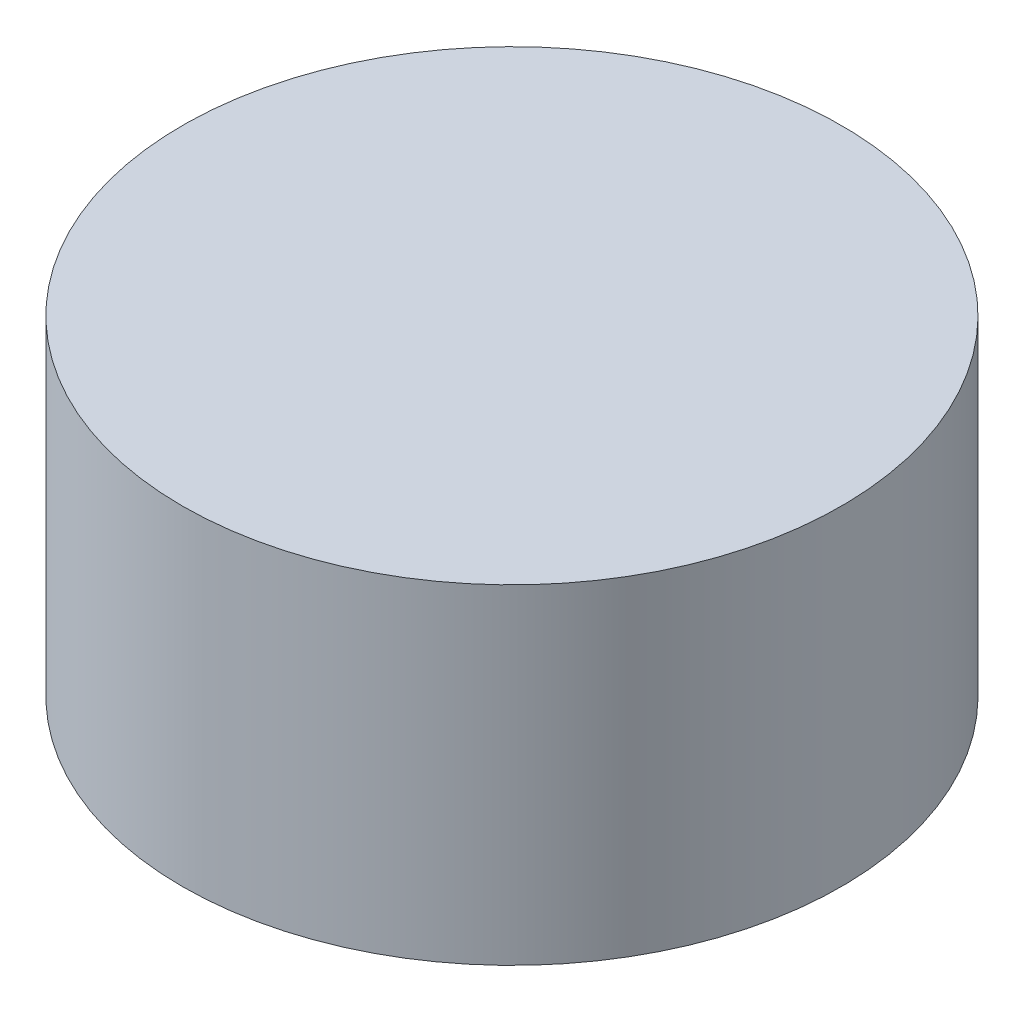
ISO-10303-21;
HEADER;
FILE_DESCRIPTION(('STEP AP214'),'2;1');
FILE_NAME('part.step','',(''),(''),'','','');
FILE_SCHEMA(('AUTOMOTIVE_DESIGN { 1 0 10303 214 1 1 1 1 }'));
ENDSEC;
DATA;
#1=APPLICATION_CONTEXT('core data for automotive mechanical design processes');
#2=APPLICATION_PROTOCOL_DEFINITION('international standard','automotive_design',2000,#1);
#3=PRODUCT_CONTEXT('',#1,'mechanical');
#4=PRODUCT('Part','Part','',(#3));
#5=PRODUCT_RELATED_PRODUCT_CATEGORY('part','',(#4));
#6=PRODUCT_DEFINITION_FORMATION('','',#4);
#7=PRODUCT_DEFINITION_CONTEXT('part definition',#1,'design');
#8=PRODUCT_DEFINITION('design','',#6,#7);
#9=PRODUCT_DEFINITION_SHAPE('','',#8);
#10=(LENGTH_UNIT() NAMED_UNIT(*) SI_UNIT(.MILLI.,.METRE.));
#11=(NAMED_UNIT(*) PLANE_ANGLE_UNIT() SI_UNIT($,.RADIAN.));
#12=(NAMED_UNIT(*) SI_UNIT($,.STERADIAN.) SOLID_ANGLE_UNIT());
#13=UNCERTAINTY_MEASURE_WITH_UNIT(LENGTH_MEASURE(1.E-05),#10,'distance_accuracy_value','');
#14=(GEOMETRIC_REPRESENTATION_CONTEXT(3) GLOBAL_UNCERTAINTY_ASSIGNED_CONTEXT((#13)) GLOBAL_UNIT_ASSIGNED_CONTEXT((#10,
#11,#12)) REPRESENTATION_CONTEXT('',''));
#15=CARTESIAN_POINT('',(0.,0.,0.));
#16=DIRECTION('',(0.,0.,1.));
#17=DIRECTION('',(1.,0.,0.));
#18=AXIS2_PLACEMENT_3D('',#15,#16,#17);
#19=CARTESIAN_POINT('',(0.,90.,0.));
#20=DIRECTION('',(0.,-1.,0.));
#21=DIRECTION('',(0.,0.,-1.));
#22=AXIS2_PLACEMENT_3D('',#19,#20,#21);
#23=CYLINDRICAL_SURFACE('',#22,90.);
#24=CARTESIAN_POINT('',(0.,90.,0.));
#25=DIRECTION('',(0.,1.,0.));
#26=DIRECTION('',(0.,0.,1.));
#27=AXIS2_PLACEMENT_3D('',#24,#25,#26);
#28=CIRCLE('',#27,90.);
#29=CARTESIAN_POINT('',(0.,90.,90.));
#30=VERTEX_POINT('',#29);
#31=EDGE_CURVE('E10',#30,#30,#28,.T.);
#32=ORIENTED_EDGE('',*,*,#31,.F.);
#33=EDGE_LOOP('',(#32));
#34=FACE_BOUND('',#33,.T.);
#35=CARTESIAN_POINT('',(0.,0.,0.));
#36=DIRECTION('',(0.,1.,0.));
#37=DIRECTION('',(0.,0.,1.));
#38=AXIS2_PLACEMENT_3D('',#35,#36,#37);
#39=CIRCLE('',#38,90.);
#40=CARTESIAN_POINT('',(0.,0.,90.));
#41=VERTEX_POINT('',#40);
#42=EDGE_CURVE('E37',#41,#41,#39,.T.);
#43=ORIENTED_EDGE('',*,*,#42,.T.);
#44=EDGE_LOOP('',(#43));
#45=FACE_BOUND('',#44,.T.);
#46=ADVANCED_FACE('F34',(#34,#45),#23,.T.);
#47=CARTESIAN_POINT('',(0.,90.,0.));
#48=DIRECTION('',(0.,1.,0.));
#49=DIRECTION('',(0.,0.,1.));
#50=AXIS2_PLACEMENT_3D('',#47,#48,#49);
#51=PLANE('',#50);
#52=ORIENTED_EDGE('',*,*,#31,.T.);
#53=EDGE_LOOP('',(#52));
#54=FACE_BOUND('',#53,.T.);
#55=ADVANCED_FACE('F51',(#54),#51,.T.);
#56=CARTESIAN_POINT('',(0.,0.,0.));
#57=DIRECTION('',(0.,1.,0.));
#58=DIRECTION('',(0.,0.,1.));
#59=AXIS2_PLACEMENT_3D('',#56,#57,#58);
#60=PLANE('',#59);
#61=ORIENTED_EDGE('',*,*,#42,.F.);
#62=EDGE_LOOP('',(#61));
#63=FACE_BOUND('',#62,.T.);
#64=ADVANCED_FACE('F49',(#63),#60,.F.);
#65=CLOSED_SHELL('',(#46,#55,#64));
#66=MANIFOLD_SOLID_BREP('B2',#65);
#67=ADVANCED_BREP_SHAPE_REPRESENTATION('',(#18,#66),#14);
#68=SHAPE_DEFINITION_REPRESENTATION(#9,#67);
ENDSEC;
END-ISO-10303-21;
